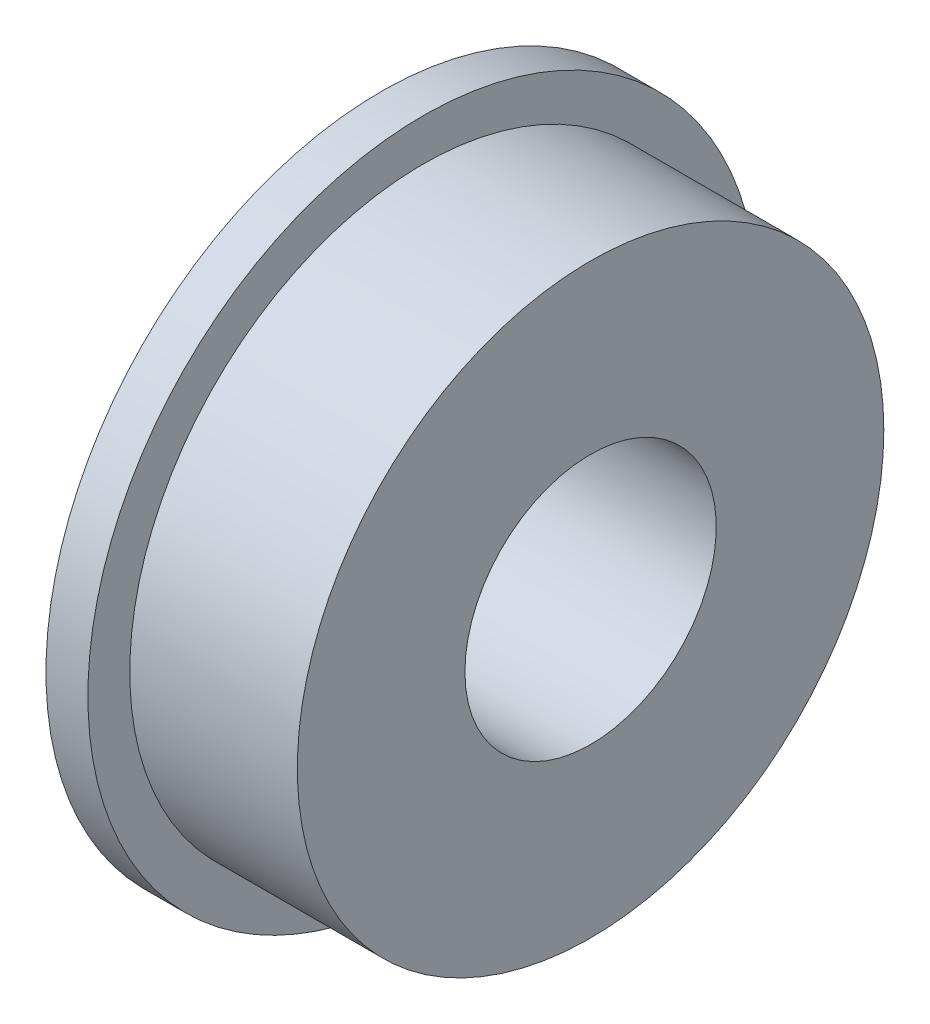
ISO-10303-21;
HEADER;
FILE_DESCRIPTION(('STEP AP214'),'2;1');
FILE_NAME('part.step','',(''),(''),'','','');
FILE_SCHEMA(('AUTOMOTIVE_DESIGN { 1 0 10303 214 1 1 1 1 }'));
ENDSEC;
DATA;
#1=APPLICATION_CONTEXT('core data for automotive mechanical design processes');
#2=APPLICATION_PROTOCOL_DEFINITION('international standard','automotive_design',2000,#1);
#3=PRODUCT_CONTEXT('',#1,'mechanical');
#4=PRODUCT('Part','Part','',(#3));
#5=PRODUCT_RELATED_PRODUCT_CATEGORY('part','',(#4));
#6=PRODUCT_DEFINITION_FORMATION('','',#4);
#7=PRODUCT_DEFINITION_CONTEXT('part definition',#1,'design');
#8=PRODUCT_DEFINITION('design','',#6,#7);
#9=PRODUCT_DEFINITION_SHAPE('','',#8);
#10=(LENGTH_UNIT() NAMED_UNIT(*) SI_UNIT(.MILLI.,.METRE.));
#11=(NAMED_UNIT(*) PLANE_ANGLE_UNIT() SI_UNIT($,.RADIAN.));
#12=(NAMED_UNIT(*) SI_UNIT($,.STERADIAN.) SOLID_ANGLE_UNIT());
#13=UNCERTAINTY_MEASURE_WITH_UNIT(LENGTH_MEASURE(1.E-05),#10,'distance_accuracy_value','');
#14=(GEOMETRIC_REPRESENTATION_CONTEXT(3) GLOBAL_UNCERTAINTY_ASSIGNED_CONTEXT((#13)) GLOBAL_UNIT_ASSIGNED_CONTEXT((#10,
#11,#12)) REPRESENTATION_CONTEXT('',''));
#15=CARTESIAN_POINT('',(0.,0.,0.));
#16=DIRECTION('',(0.,0.,1.));
#17=DIRECTION('',(1.,0.,0.));
#18=AXIS2_PLACEMENT_3D('',#15,#16,#17);
#19=CARTESIAN_POINT('',(3.175,0.,0.));
#20=DIRECTION('',(-1.,0.,0.));
#21=DIRECTION('',(0.,0.,1.));
#22=AXIS2_PLACEMENT_3D('',#19,#20,#21);
#23=CYLINDRICAL_SURFACE('',#22,25.4);
#24=CARTESIAN_POINT('',(3.175,0.,0.));
#25=DIRECTION('',(1.,0.,0.));
#26=DIRECTION('',(0.,0.,-1.));
#27=AXIS2_PLACEMENT_3D('',#24,#25,#26);
#28=CIRCLE('',#27,25.4);
#29=CARTESIAN_POINT('',(3.175,0.,-25.4));
#30=VERTEX_POINT('',#29);
#31=EDGE_CURVE('E38',#30,#30,#28,.T.);
#32=ORIENTED_EDGE('',*,*,#31,.F.);
#33=EDGE_LOOP('',(#32));
#34=FACE_BOUND('',#33,.T.);
#35=CARTESIAN_POINT('',(0.,0.,0.));
#36=DIRECTION('',(1.,0.,0.));
#37=DIRECTION('',(0.,0.,-1.));
#38=AXIS2_PLACEMENT_3D('',#35,#36,#37);
#39=CIRCLE('',#38,25.4);
#40=CARTESIAN_POINT('',(0.,0.,-25.4));
#41=VERTEX_POINT('',#40);
#42=EDGE_CURVE('E34',#41,#41,#39,.T.);
#43=ORIENTED_EDGE('',*,*,#42,.T.);
#44=EDGE_LOOP('',(#43));
#45=FACE_BOUND('',#44,.T.);
#46=ADVANCED_FACE('F31',(#34,#45),#23,.T.);
#47=CARTESIAN_POINT('',(3.175,0.,0.));
#48=DIRECTION('',(1.,0.,0.));
#49=DIRECTION('',(0.,0.,-1.));
#50=AXIS2_PLACEMENT_3D('',#47,#48,#49);
#51=PLANE('',#50);
#52=CARTESIAN_POINT('',(3.175,0.,0.));
#53=DIRECTION('',(1.,0.,0.));
#54=DIRECTION('',(0.,0.,-1.));
#55=AXIS2_PLACEMENT_3D('',#52,#53,#54);
#56=CIRCLE('',#55,22.225);
#57=CARTESIAN_POINT('',(3.175,0.,-22.225));
#58=VERTEX_POINT('',#57);
#59=EDGE_CURVE('E10',#58,#58,#56,.T.);
#60=ORIENTED_EDGE('',*,*,#59,.F.);
#61=EDGE_LOOP('',(#60));
#62=FACE_BOUND('',#61,.T.);
#63=ORIENTED_EDGE('',*,*,#31,.T.);
#64=EDGE_LOOP('',(#63));
#65=FACE_BOUND('',#64,.T.);
#66=ADVANCED_FACE('F67',(#62,#65),#51,.T.);
#67=CARTESIAN_POINT('',(0.,0.,0.));
#68=DIRECTION('',(1.,0.,0.));
#69=DIRECTION('',(0.,0.,-1.));
#70=AXIS2_PLACEMENT_3D('',#67,#68,#69);
#71=PLANE('',#70);
#72=CARTESIAN_POINT('',(0.,0.,0.));
#73=DIRECTION('',(-1.,0.,0.));
#74=DIRECTION('',(0.,0.,1.));
#75=AXIS2_PLACEMENT_3D('',#72,#73,#74);
#76=CIRCLE('',#75,9.525);
#77=CARTESIAN_POINT('',(0.,0.,9.525));
#78=VERTEX_POINT('',#77);
#79=EDGE_CURVE('E48',#78,#78,#76,.T.);
#80=ORIENTED_EDGE('',*,*,#79,.F.);
#81=EDGE_LOOP('',(#80));
#82=FACE_BOUND('',#81,.T.);
#83=ORIENTED_EDGE('',*,*,#42,.F.);
#84=EDGE_LOOP('',(#83));
#85=FACE_BOUND('',#84,.T.);
#86=ADVANCED_FACE('F63',(#82,#85),#71,.F.);
#87=CARTESIAN_POINT('',(15.875,0.,0.));
#88=DIRECTION('',(-1.,0.,0.));
#89=DIRECTION('',(0.,0.,1.));
#90=AXIS2_PLACEMENT_3D('',#87,#88,#89);
#91=CYLINDRICAL_SURFACE('',#90,22.225);
#92=CARTESIAN_POINT('',(15.875,0.,0.));
#93=DIRECTION('',(1.,0.,0.));
#94=DIRECTION('',(0.,0.,-1.));
#95=AXIS2_PLACEMENT_3D('',#92,#93,#94);
#96=CIRCLE('',#95,22.225);
#97=CARTESIAN_POINT('',(15.875,0.,-22.225));
#98=VERTEX_POINT('',#97);
#99=EDGE_CURVE('E44',#98,#98,#96,.T.);
#100=ORIENTED_EDGE('',*,*,#99,.F.);
#101=EDGE_LOOP('',(#100));
#102=FACE_BOUND('',#101,.T.);
#103=ORIENTED_EDGE('',*,*,#59,.T.);
#104=EDGE_LOOP('',(#103));
#105=FACE_BOUND('',#104,.T.);
#106=ADVANCED_FACE('F66',(#102,#105),#91,.T.);
#107=CARTESIAN_POINT('',(15.875,0.,0.));
#108=DIRECTION('',(1.,0.,0.));
#109=DIRECTION('',(0.,0.,-1.));
#110=AXIS2_PLACEMENT_3D('',#107,#108,#109);
#111=PLANE('',#110);
#112=CARTESIAN_POINT('',(15.875,0.,0.));
#113=DIRECTION('',(-1.,0.,0.));
#114=DIRECTION('',(0.,0.,1.));
#115=AXIS2_PLACEMENT_3D('',#112,#113,#114);
#116=CIRCLE('',#115,9.525);
#117=CARTESIAN_POINT('',(15.875,0.,9.525));
#118=VERTEX_POINT('',#117);
#119=EDGE_CURVE('E47',#118,#118,#116,.T.);
#120=ORIENTED_EDGE('',*,*,#119,.T.);
#121=EDGE_LOOP('',(#120));
#122=FACE_BOUND('',#121,.T.);
#123=ORIENTED_EDGE('',*,*,#99,.T.);
#124=EDGE_LOOP('',(#123));
#125=FACE_BOUND('',#124,.T.);
#126=ADVANCED_FACE('F54',(#122,#125),#111,.T.);
#127=CARTESIAN_POINT('',(15.875,0.,0.));
#128=DIRECTION('',(-1.,0.,0.));
#129=DIRECTION('',(0.,0.,1.));
#130=AXIS2_PLACEMENT_3D('',#127,#128,#129);
#131=CYLINDRICAL_SURFACE('',#130,9.525);
#132=ORIENTED_EDGE('',*,*,#119,.F.);
#133=EDGE_LOOP('',(#132));
#134=FACE_BOUND('',#133,.T.);
#135=ORIENTED_EDGE('',*,*,#79,.T.);
#136=EDGE_LOOP('',(#135));
#137=FACE_BOUND('',#136,.T.);
#138=ADVANCED_FACE('F57',(#134,#137),#131,.F.);
#139=CLOSED_SHELL('',(#46,#66,#86,#106,#126,#138));
#140=MANIFOLD_SOLID_BREP('B2',#139);
#141=ADVANCED_BREP_SHAPE_REPRESENTATION('',(#18,#140),#14);
#142=SHAPE_DEFINITION_REPRESENTATION(#9,#141);
ENDSEC;
END-ISO-10303-21;
